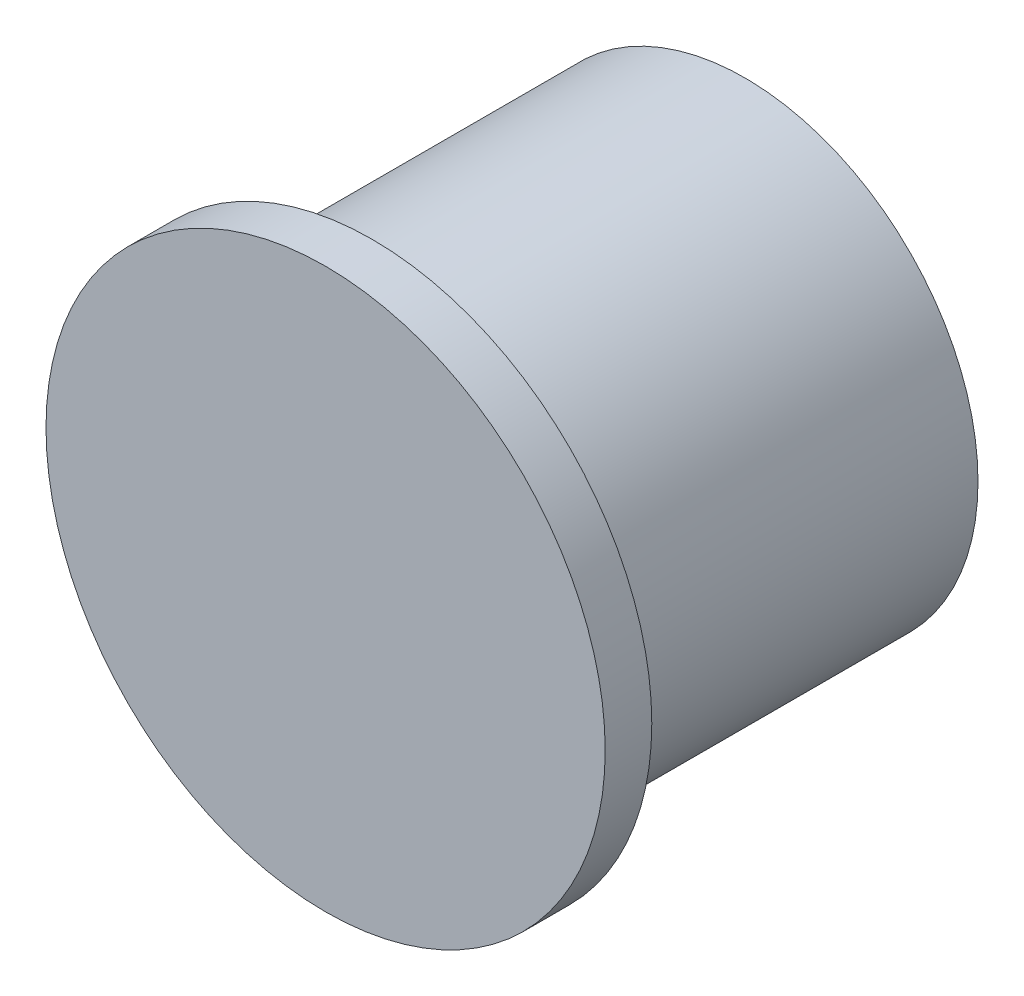
ISO-10303-21;
HEADER;
FILE_DESCRIPTION(('STEP AP214'),'2;1');
FILE_NAME('part.step','',(''),(''),'','','');
FILE_SCHEMA(('AUTOMOTIVE_DESIGN { 1 0 10303 214 1 1 1 1 }'));
ENDSEC;
DATA;
#1=APPLICATION_CONTEXT('core data for automotive mechanical design processes');
#2=APPLICATION_PROTOCOL_DEFINITION('international standard','automotive_design',2000,#1);
#3=PRODUCT_CONTEXT('',#1,'mechanical');
#4=PRODUCT('Part','Part','',(#3));
#5=PRODUCT_RELATED_PRODUCT_CATEGORY('part','',(#4));
#6=PRODUCT_DEFINITION_FORMATION('','',#4);
#7=PRODUCT_DEFINITION_CONTEXT('part definition',#1,'design');
#8=PRODUCT_DEFINITION('design','',#6,#7);
#9=PRODUCT_DEFINITION_SHAPE('','',#8);
#10=(LENGTH_UNIT() NAMED_UNIT(*) SI_UNIT(.MILLI.,.METRE.));
#11=(NAMED_UNIT(*) PLANE_ANGLE_UNIT() SI_UNIT($,.RADIAN.));
#12=(NAMED_UNIT(*) SI_UNIT($,.STERADIAN.) SOLID_ANGLE_UNIT());
#13=UNCERTAINTY_MEASURE_WITH_UNIT(LENGTH_MEASURE(1.E-05),#10,'distance_accuracy_value','');
#14=(GEOMETRIC_REPRESENTATION_CONTEXT(3) GLOBAL_UNCERTAINTY_ASSIGNED_CONTEXT((#13)) GLOBAL_UNIT_ASSIGNED_CONTEXT((#10,
#11,#12)) REPRESENTATION_CONTEXT('',''));
#15=CARTESIAN_POINT('',(0.,0.,0.));
#16=DIRECTION('',(0.,0.,1.));
#17=DIRECTION('',(1.,0.,0.));
#18=AXIS2_PLACEMENT_3D('',#15,#16,#17);
#19=CARTESIAN_POINT('',(0.,0.,8.));
#20=DIRECTION('',(0.,0.,-1.));
#21=DIRECTION('',(-1.,0.,0.));
#22=AXIS2_PLACEMENT_3D('',#19,#20,#21);
#23=CYLINDRICAL_SURFACE('',#22,5.);
#24=CARTESIAN_POINT('',(0.,0.,8.));
#25=DIRECTION('',(0.,0.,1.));
#26=DIRECTION('',(1.,0.,0.));
#27=AXIS2_PLACEMENT_3D('',#24,#25,#26);
#28=CIRCLE('',#27,5.);
#29=CARTESIAN_POINT('',(5.,0.,8.));
#30=VERTEX_POINT('',#29);
#31=EDGE_CURVE('E10',#30,#30,#28,.T.);
#32=ORIENTED_EDGE('',*,*,#31,.F.);
#33=EDGE_LOOP('',(#32));
#34=FACE_BOUND('',#33,.T.);
#35=CARTESIAN_POINT('',(0.,0.,0.));
#36=DIRECTION('',(0.,0.,1.));
#37=DIRECTION('',(1.,0.,0.));
#38=AXIS2_PLACEMENT_3D('',#35,#36,#37);
#39=CIRCLE('',#38,5.);
#40=CARTESIAN_POINT('',(5.,0.,0.));
#41=VERTEX_POINT('',#40);
#42=EDGE_CURVE('E34',#41,#41,#39,.T.);
#43=ORIENTED_EDGE('',*,*,#42,.T.);
#44=EDGE_LOOP('',(#43));
#45=FACE_BOUND('',#44,.T.);
#46=ADVANCED_FACE('F31',(#34,#45),#23,.T.);
#47=CARTESIAN_POINT('',(0.,0.,0.));
#48=DIRECTION('',(0.,0.,1.));
#49=DIRECTION('',(1.,0.,0.));
#50=AXIS2_PLACEMENT_3D('',#47,#48,#49);
#51=PLANE('',#50);
#52=ORIENTED_EDGE('',*,*,#42,.F.);
#53=EDGE_LOOP('',(#52));
#54=FACE_BOUND('',#53,.T.);
#55=ADVANCED_FACE('F54',(#54),#51,.F.);
#56=CARTESIAN_POINT('',(0.,0.,9.));
#57=DIRECTION('',(0.,0.,-1.));
#58=DIRECTION('',(-1.,0.,0.));
#59=AXIS2_PLACEMENT_3D('',#56,#57,#58);
#60=CYLINDRICAL_SURFACE('',#59,6.);
#61=CARTESIAN_POINT('',(0.,0.,9.));
#62=DIRECTION('',(0.,0.,1.));
#63=DIRECTION('',(1.,0.,0.));
#64=AXIS2_PLACEMENT_3D('',#61,#62,#63);
#65=CIRCLE('',#64,6.);
#66=CARTESIAN_POINT('',(6.,0.,9.));
#67=VERTEX_POINT('',#66);
#68=EDGE_CURVE('E41',#67,#67,#65,.T.);
#69=ORIENTED_EDGE('',*,*,#68,.F.);
#70=EDGE_LOOP('',(#69));
#71=FACE_BOUND('',#70,.T.);
#72=CARTESIAN_POINT('',(0.,0.,8.));
#73=DIRECTION('',(0.,0.,1.));
#74=DIRECTION('',(1.,0.,0.));
#75=AXIS2_PLACEMENT_3D('',#72,#73,#74);
#76=CIRCLE('',#75,6.);
#77=CARTESIAN_POINT('',(6.,0.,8.));
#78=VERTEX_POINT('',#77);
#79=EDGE_CURVE('E43',#78,#78,#76,.T.);
#80=ORIENTED_EDGE('',*,*,#79,.T.);
#81=EDGE_LOOP('',(#80));
#82=FACE_BOUND('',#81,.T.);
#83=ADVANCED_FACE('F51',(#71,#82),#60,.T.);
#84=CARTESIAN_POINT('',(0.,0.,9.));
#85=DIRECTION('',(0.,0.,1.));
#86=DIRECTION('',(1.,0.,0.));
#87=AXIS2_PLACEMENT_3D('',#84,#85,#86);
#88=PLANE('',#87);
#89=ORIENTED_EDGE('',*,*,#68,.T.);
#90=EDGE_LOOP('',(#89));
#91=FACE_BOUND('',#90,.T.);
#92=ADVANCED_FACE('F49',(#91),#88,.T.);
#93=CARTESIAN_POINT('',(0.,0.,8.));
#94=DIRECTION('',(0.,0.,1.));
#95=DIRECTION('',(1.,0.,0.));
#96=AXIS2_PLACEMENT_3D('',#93,#94,#95);
#97=PLANE('',#96);
#98=ORIENTED_EDGE('',*,*,#31,.T.);
#99=EDGE_LOOP('',(#98));
#100=FACE_BOUND('',#99,.T.);
#101=ORIENTED_EDGE('',*,*,#79,.F.);
#102=EDGE_LOOP('',(#101));
#103=FACE_BOUND('',#102,.T.);
#104=ADVANCED_FACE('F58',(#100,#103),#97,.F.);
#105=CLOSED_SHELL('',(#46,#55,#83,#92,#104));
#106=MANIFOLD_SOLID_BREP('B2',#105);
#107=ADVANCED_BREP_SHAPE_REPRESENTATION('',(#18,#106),#14);
#108=SHAPE_DEFINITION_REPRESENTATION(#9,#107);
ENDSEC;
END-ISO-10303-21;
